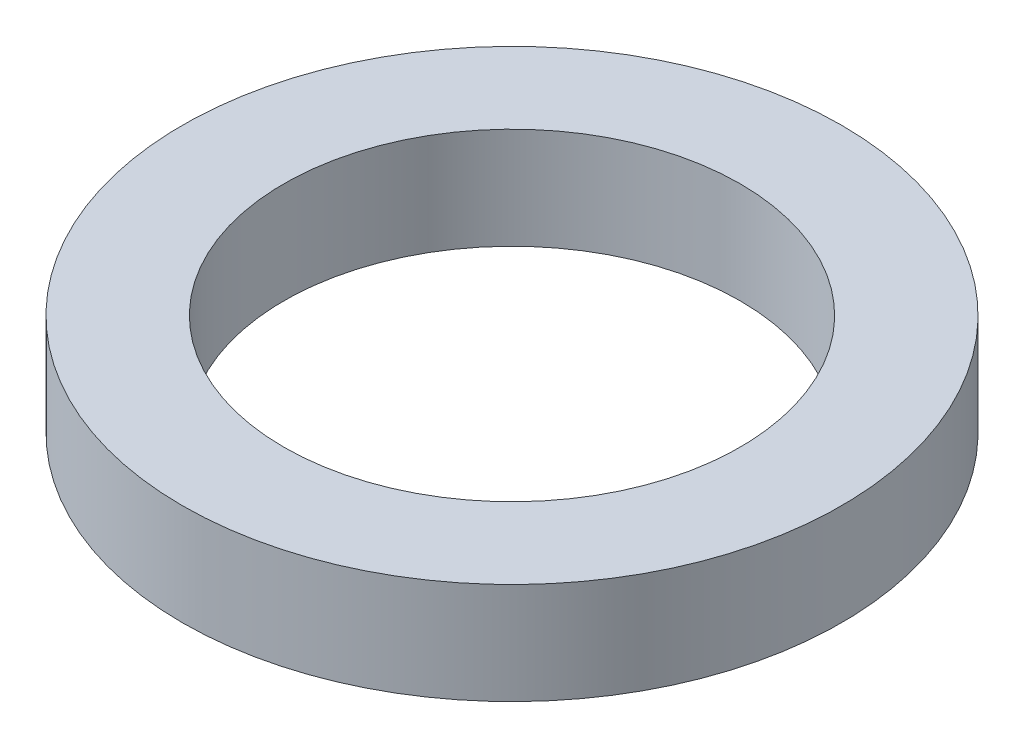
ISO-10303-21;
HEADER;
FILE_DESCRIPTION(('STEP AP214'),'2;1');
FILE_NAME('part.step','',(''),(''),'','','');
FILE_SCHEMA(('AUTOMOTIVE_DESIGN { 1 0 10303 214 1 1 1 1 }'));
ENDSEC;
DATA;
#1=APPLICATION_CONTEXT('core data for automotive mechanical design processes');
#2=APPLICATION_PROTOCOL_DEFINITION('international standard','automotive_design',2000,#1);
#3=PRODUCT_CONTEXT('',#1,'mechanical');
#4=PRODUCT('Part','Part','',(#3));
#5=PRODUCT_RELATED_PRODUCT_CATEGORY('part','',(#4));
#6=PRODUCT_DEFINITION_FORMATION('','',#4);
#7=PRODUCT_DEFINITION_CONTEXT('part definition',#1,'design');
#8=PRODUCT_DEFINITION('design','',#6,#7);
#9=PRODUCT_DEFINITION_SHAPE('','',#8);
#10=(LENGTH_UNIT() NAMED_UNIT(*) SI_UNIT(.MILLI.,.METRE.));
#11=(NAMED_UNIT(*) PLANE_ANGLE_UNIT() SI_UNIT($,.RADIAN.));
#12=(NAMED_UNIT(*) SI_UNIT($,.STERADIAN.) SOLID_ANGLE_UNIT());
#13=UNCERTAINTY_MEASURE_WITH_UNIT(LENGTH_MEASURE(1.E-05),#10,'distance_accuracy_value','');
#14=(GEOMETRIC_REPRESENTATION_CONTEXT(3) GLOBAL_UNCERTAINTY_ASSIGNED_CONTEXT((#13)) GLOBAL_UNIT_ASSIGNED_CONTEXT((#10,
#11,#12)) REPRESENTATION_CONTEXT('',''));
#15=CARTESIAN_POINT('',(0.,0.,0.));
#16=DIRECTION('',(0.,0.,1.));
#17=DIRECTION('',(1.,0.,0.));
#18=AXIS2_PLACEMENT_3D('',#15,#16,#17);
#19=CARTESIAN_POINT('',(0.,10.,0.));
#20=DIRECTION('',(0.,-1.,0.));
#21=DIRECTION('',(0.,0.,-1.));
#22=AXIS2_PLACEMENT_3D('',#19,#20,#21);
#23=CYLINDRICAL_SURFACE('',#22,32.5);
#24=CARTESIAN_POINT('',(0.,10.,0.));
#25=DIRECTION('',(0.,1.,0.));
#26=DIRECTION('',(0.,0.,1.));
#27=AXIS2_PLACEMENT_3D('',#24,#25,#26);
#28=CIRCLE('',#27,32.5);
#29=CARTESIAN_POINT('',(0.,10.,32.5));
#30=VERTEX_POINT('',#29);
#31=EDGE_CURVE('E10',#30,#30,#28,.T.);
#32=ORIENTED_EDGE('',*,*,#31,.F.);
#33=EDGE_LOOP('',(#32));
#34=FACE_BOUND('',#33,.T.);
#35=CARTESIAN_POINT('',(0.,0.,0.));
#36=DIRECTION('',(0.,1.,0.));
#37=DIRECTION('',(0.,0.,1.));
#38=AXIS2_PLACEMENT_3D('',#35,#36,#37);
#39=CIRCLE('',#38,32.5);
#40=CARTESIAN_POINT('',(0.,0.,32.5));
#41=VERTEX_POINT('',#40);
#42=EDGE_CURVE('E37',#41,#41,#39,.T.);
#43=ORIENTED_EDGE('',*,*,#42,.T.);
#44=EDGE_LOOP('',(#43));
#45=FACE_BOUND('',#44,.T.);
#46=ADVANCED_FACE('F40',(#34,#45),#23,.T.);
#47=CARTESIAN_POINT('',(0.,10.,0.));
#48=DIRECTION('',(0.,1.,0.));
#49=DIRECTION('',(0.,0.,1.));
#50=AXIS2_PLACEMENT_3D('',#47,#48,#49);
#51=PLANE('',#50);
#52=CARTESIAN_POINT('',(0.,10.,0.));
#53=DIRECTION('',(0.,1.,0.));
#54=DIRECTION('',(0.,0.,1.));
#55=AXIS2_PLACEMENT_3D('',#52,#53,#54);
#56=CIRCLE('',#55,22.5);
#57=CARTESIAN_POINT('',(0.,10.,22.5));
#58=VERTEX_POINT('',#57);
#59=EDGE_CURVE('E50',#58,#58,#56,.T.);
#60=ORIENTED_EDGE('',*,*,#59,.F.);
#61=EDGE_LOOP('',(#60));
#62=FACE_BOUND('',#61,.T.);
#63=ORIENTED_EDGE('',*,*,#31,.T.);
#64=EDGE_LOOP('',(#63));
#65=FACE_BOUND('',#64,.T.);
#66=ADVANCED_FACE('F59',(#62,#65),#51,.T.);
#67=CARTESIAN_POINT('',(0.,0.,0.));
#68=DIRECTION('',(0.,1.,0.));
#69=DIRECTION('',(0.,0.,1.));
#70=AXIS2_PLACEMENT_3D('',#67,#68,#69);
#71=PLANE('',#70);
#72=CARTESIAN_POINT('',(0.,0.,0.));
#73=DIRECTION('',(0.,1.,0.));
#74=DIRECTION('',(0.,0.,1.));
#75=AXIS2_PLACEMENT_3D('',#72,#73,#74);
#76=CIRCLE('',#75,22.5);
#77=CARTESIAN_POINT('',(0.,0.,22.5));
#78=VERTEX_POINT('',#77);
#79=EDGE_CURVE('E47',#78,#78,#76,.T.);
#80=ORIENTED_EDGE('',*,*,#79,.T.);
#81=EDGE_LOOP('',(#80));
#82=FACE_BOUND('',#81,.T.);
#83=ORIENTED_EDGE('',*,*,#42,.F.);
#84=EDGE_LOOP('',(#83));
#85=FACE_BOUND('',#84,.T.);
#86=ADVANCED_FACE('F58',(#82,#85),#71,.F.);
#87=CARTESIAN_POINT('',(0.,10.,0.));
#88=DIRECTION('',(0.,-1.,0.));
#89=DIRECTION('',(0.,0.,-1.));
#90=AXIS2_PLACEMENT_3D('',#87,#88,#89);
#91=CYLINDRICAL_SURFACE('',#90,22.5);
#92=ORIENTED_EDGE('',*,*,#59,.T.);
#93=EDGE_LOOP('',(#92));
#94=FACE_BOUND('',#93,.T.);
#95=ORIENTED_EDGE('',*,*,#79,.F.);
#96=EDGE_LOOP('',(#95));
#97=FACE_BOUND('',#96,.T.);
#98=ADVANCED_FACE('F54',(#94,#97),#91,.F.);
#99=CLOSED_SHELL('',(#46,#66,#86,#98));
#100=MANIFOLD_SOLID_BREP('B2',#99);
#101=ADVANCED_BREP_SHAPE_REPRESENTATION('',(#18,#100),#14);
#102=SHAPE_DEFINITION_REPRESENTATION(#9,#101);
ENDSEC;
END-ISO-10303-21;
